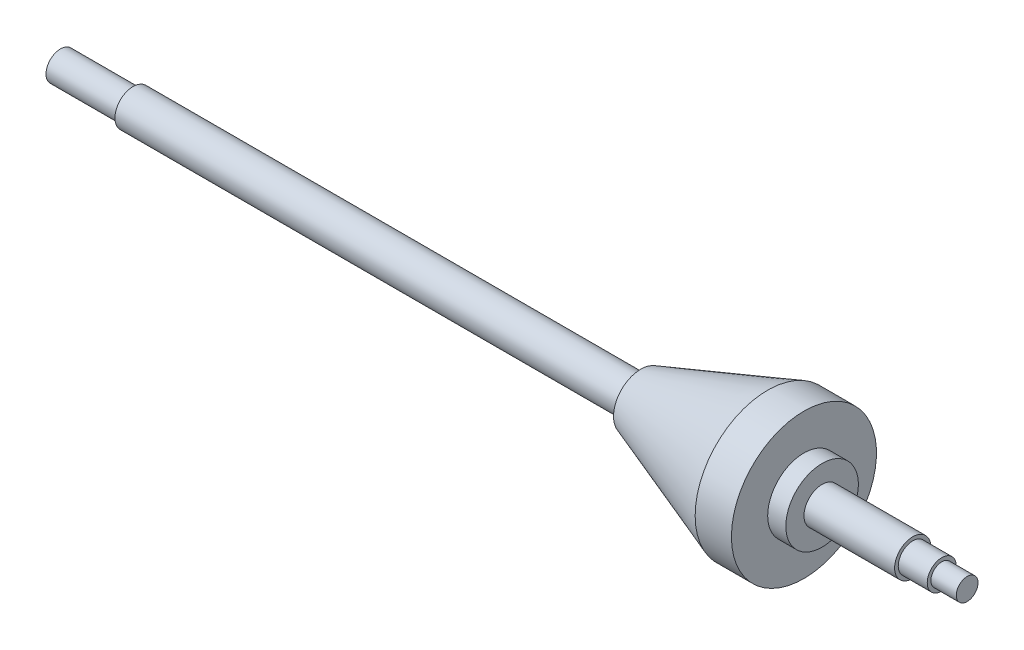
ISO-10303-21;
HEADER;
FILE_DESCRIPTION(('STEP AP214'),'2;1');
FILE_NAME('part.step','',(''),(''),'','','');
FILE_SCHEMA(('AUTOMOTIVE_DESIGN { 1 0 10303 214 1 1 1 1 }'));
ENDSEC;
DATA;
#1=APPLICATION_CONTEXT('core data for automotive mechanical design processes');
#2=APPLICATION_PROTOCOL_DEFINITION('international standard','automotive_design',2000,#1);
#3=PRODUCT_CONTEXT('',#1,'mechanical');
#4=PRODUCT('Part','Part','',(#3));
#5=PRODUCT_RELATED_PRODUCT_CATEGORY('part','',(#4));
#6=PRODUCT_DEFINITION_FORMATION('','',#4);
#7=PRODUCT_DEFINITION_CONTEXT('part definition',#1,'design');
#8=PRODUCT_DEFINITION('design','',#6,#7);
#9=PRODUCT_DEFINITION_SHAPE('','',#8);
#10=(LENGTH_UNIT() NAMED_UNIT(*) SI_UNIT(.MILLI.,.METRE.));
#11=(NAMED_UNIT(*) PLANE_ANGLE_UNIT() SI_UNIT($,.RADIAN.));
#12=(NAMED_UNIT(*) SI_UNIT($,.STERADIAN.) SOLID_ANGLE_UNIT());
#13=UNCERTAINTY_MEASURE_WITH_UNIT(LENGTH_MEASURE(1.E-05),#10,'distance_accuracy_value','');
#14=(GEOMETRIC_REPRESENTATION_CONTEXT(3) GLOBAL_UNCERTAINTY_ASSIGNED_CONTEXT((#13)) GLOBAL_UNIT_ASSIGNED_CONTEXT((#10,
#11,#12)) REPRESENTATION_CONTEXT('',''));
#15=CARTESIAN_POINT('',(0.,0.,0.));
#16=DIRECTION('',(0.,0.,1.));
#17=DIRECTION('',(1.,0.,0.));
#18=AXIS2_PLACEMENT_3D('',#15,#16,#17);
#19=CARTESIAN_POINT('',(0.,0.,0.));
#20=DIRECTION('',(1.,0.,0.));
#21=DIRECTION('',(0.,0.,-1.));
#22=AXIS2_PLACEMENT_3D('',#19,#20,#21);
#23=PLANE('',#22);
#24=CARTESIAN_POINT('',(0.,0.,0.));
#25=DIRECTION('',(-1.,0.,0.));
#26=DIRECTION('',(0.,0.,1.));
#27=AXIS2_PLACEMENT_3D('',#24,#25,#26);
#28=CIRCLE('',#27,4.);
#29=CARTESIAN_POINT('',(0.,0.,4.));
#30=VERTEX_POINT('',#29);
#31=EDGE_CURVE('E10',#30,#30,#28,.T.);
#32=ORIENTED_EDGE('',*,*,#31,.T.);
#33=EDGE_LOOP('',(#32));
#34=FACE_BOUND('',#33,.T.);
#35=ADVANCED_FACE('F31',(#34),#23,.F.);
#36=CARTESIAN_POINT('',(0.,0.,0.));
#37=DIRECTION('',(-1.,0.,0.));
#38=DIRECTION('',(0.,0.,1.));
#39=AXIS2_PLACEMENT_3D('',#36,#37,#38);
#40=CYLINDRICAL_SURFACE('',#39,4.);
#41=ORIENTED_EDGE('',*,*,#31,.F.);
#42=EDGE_LOOP('',(#41));
#43=FACE_BOUND('',#42,.T.);
#44=CARTESIAN_POINT('',(20.,0.,0.));
#45=DIRECTION('',(-1.,0.,0.));
#46=DIRECTION('',(0.,0.,1.));
#47=AXIS2_PLACEMENT_3D('',#44,#45,#46);
#48=CIRCLE('',#47,4.);
#49=CARTESIAN_POINT('',(20.,0.,4.));
#50=VERTEX_POINT('',#49);
#51=EDGE_CURVE('E37',#50,#50,#48,.T.);
#52=ORIENTED_EDGE('',*,*,#51,.T.);
#53=EDGE_LOOP('',(#52));
#54=FACE_BOUND('',#53,.T.);
#55=ADVANCED_FACE('F96',(#43,#54),#40,.T.);
#56=CARTESIAN_POINT('',(20.,4.,0.));
#57=DIRECTION('',(1.,0.,0.));
#58=DIRECTION('',(0.,0.,-1.));
#59=AXIS2_PLACEMENT_3D('',#56,#57,#58);
#60=PLANE('',#59);
#61=ORIENTED_EDGE('',*,*,#51,.F.);
#62=EDGE_LOOP('',(#61));
#63=FACE_BOUND('',#62,.T.);
#64=CARTESIAN_POINT('',(20.,0.,0.));
#65=DIRECTION('',(-1.,0.,0.));
#66=DIRECTION('',(0.,0.,1.));
#67=AXIS2_PLACEMENT_3D('',#64,#65,#66);
#68=CIRCLE('',#67,5.);
#69=CARTESIAN_POINT('',(20.,0.,5.));
#70=VERTEX_POINT('',#69);
#71=EDGE_CURVE('E41',#70,#70,#68,.T.);
#72=ORIENTED_EDGE('',*,*,#71,.T.);
#73=EDGE_LOOP('',(#72));
#74=FACE_BOUND('',#73,.T.);
#75=ADVANCED_FACE('F100',(#63,#74),#60,.F.);
#76=CARTESIAN_POINT('',(0.,0.,0.));
#77=DIRECTION('',(-1.,0.,0.));
#78=DIRECTION('',(0.,0.,1.));
#79=AXIS2_PLACEMENT_3D('',#76,#77,#78);
#80=CYLINDRICAL_SURFACE('',#79,5.);
#81=ORIENTED_EDGE('',*,*,#71,.F.);
#82=EDGE_LOOP('',(#81));
#83=FACE_BOUND('',#82,.T.);
#84=CARTESIAN_POINT('',(160.,0.,0.));
#85=DIRECTION('',(-1.,0.,0.));
#86=DIRECTION('',(0.,0.,1.));
#87=AXIS2_PLACEMENT_3D('',#84,#85,#86);
#88=CIRCLE('',#87,5.);
#89=CARTESIAN_POINT('',(160.,0.,5.));
#90=VERTEX_POINT('',#89);
#91=EDGE_CURVE('E45',#90,#90,#88,.T.);
#92=ORIENTED_EDGE('',*,*,#91,.T.);
#93=EDGE_LOOP('',(#92));
#94=FACE_BOUND('',#93,.T.);
#95=ADVANCED_FACE('F105',(#83,#94),#80,.T.);
#96=CARTESIAN_POINT('',(160.,5.,0.));
#97=DIRECTION('',(1.,0.,0.));
#98=DIRECTION('',(0.,0.,-1.));
#99=AXIS2_PLACEMENT_3D('',#96,#97,#98);
#100=PLANE('',#99);
#101=ORIENTED_EDGE('',*,*,#91,.F.);
#102=EDGE_LOOP('',(#101));
#103=FACE_BOUND('',#102,.T.);
#104=CARTESIAN_POINT('',(160.,0.,0.));
#105=DIRECTION('',(-1.,0.,0.));
#106=DIRECTION('',(0.,0.,1.));
#107=AXIS2_PLACEMENT_3D('',#104,#105,#106);
#108=CIRCLE('',#107,7.5);
#109=CARTESIAN_POINT('',(160.,0.,7.5));
#110=VERTEX_POINT('',#109);
#111=EDGE_CURVE('E50',#110,#110,#108,.T.);
#112=ORIENTED_EDGE('',*,*,#111,.T.);
#113=EDGE_LOOP('',(#112));
#114=FACE_BOUND('',#113,.T.);
#115=ADVANCED_FACE('F111',(#103,#114),#100,.F.);
#116=CARTESIAN_POINT('',(195.,0.,0.));
#117=DIRECTION('',(1.,0.,0.));
#118=DIRECTION('',(0.,0.,-1.));
#119=AXIS2_PLACEMENT_3D('',#116,#117,#118);
#120=CONICAL_SURFACE('',#119,20.,0.343023940420704);
#121=ORIENTED_EDGE('',*,*,#111,.F.);
#122=EDGE_LOOP('',(#121));
#123=FACE_BOUND('',#122,.T.);
#124=CARTESIAN_POINT('',(195.,0.,0.));
#125=DIRECTION('',(-1.,0.,0.));
#126=DIRECTION('',(0.,0.,1.));
#127=AXIS2_PLACEMENT_3D('',#124,#125,#126);
#128=CIRCLE('',#127,20.);
#129=CARTESIAN_POINT('',(195.,0.,20.));
#130=VERTEX_POINT('',#129);
#131=EDGE_CURVE('E53',#130,#130,#128,.T.);
#132=ORIENTED_EDGE('',*,*,#131,.T.);
#133=EDGE_LOOP('',(#132));
#134=FACE_BOUND('',#133,.T.);
#135=ADVANCED_FACE('F115',(#123,#134),#120,.T.);
#136=CARTESIAN_POINT('',(0.,0.,0.));
#137=DIRECTION('',(-1.,0.,0.));
#138=DIRECTION('',(0.,0.,1.));
#139=AXIS2_PLACEMENT_3D('',#136,#137,#138);
#140=CYLINDRICAL_SURFACE('',#139,20.);
#141=ORIENTED_EDGE('',*,*,#131,.F.);
#142=EDGE_LOOP('',(#141));
#143=FACE_BOUND('',#142,.T.);
#144=CARTESIAN_POINT('',(205.,0.,0.));
#145=DIRECTION('',(-1.,0.,0.));
#146=DIRECTION('',(0.,0.,1.));
#147=AXIS2_PLACEMENT_3D('',#144,#145,#146);
#148=CIRCLE('',#147,20.);
#149=CARTESIAN_POINT('',(205.,0.,20.));
#150=VERTEX_POINT('',#149);
#151=EDGE_CURVE('E56',#150,#150,#148,.T.);
#152=ORIENTED_EDGE('',*,*,#151,.T.);
#153=EDGE_LOOP('',(#152));
#154=FACE_BOUND('',#153,.T.);
#155=ADVANCED_FACE('F119',(#143,#154),#140,.T.);
#156=CARTESIAN_POINT('',(205.,20.,0.));
#157=DIRECTION('',(-1.,0.,0.));
#158=DIRECTION('',(0.,0.,1.));
#159=AXIS2_PLACEMENT_3D('',#156,#157,#158);
#160=PLANE('',#159);
#161=ORIENTED_EDGE('',*,*,#151,.F.);
#162=EDGE_LOOP('',(#161));
#163=FACE_BOUND('',#162,.T.);
#164=CARTESIAN_POINT('',(205.,0.,0.));
#165=DIRECTION('',(-1.,0.,0.));
#166=DIRECTION('',(0.,0.,1.));
#167=AXIS2_PLACEMENT_3D('',#164,#165,#166);
#168=CIRCLE('',#167,10.);
#169=CARTESIAN_POINT('',(205.,0.,10.));
#170=VERTEX_POINT('',#169);
#171=EDGE_CURVE('E59',#170,#170,#168,.T.);
#172=ORIENTED_EDGE('',*,*,#171,.T.);
#173=EDGE_LOOP('',(#172));
#174=FACE_BOUND('',#173,.T.);
#175=ADVANCED_FACE('F123',(#163,#174),#160,.F.);
#176=CARTESIAN_POINT('',(0.,0.,0.));
#177=DIRECTION('',(-1.,0.,0.));
#178=DIRECTION('',(0.,0.,1.));
#179=AXIS2_PLACEMENT_3D('',#176,#177,#178);
#180=CYLINDRICAL_SURFACE('',#179,10.);
#181=ORIENTED_EDGE('',*,*,#171,.F.);
#182=EDGE_LOOP('',(#181));
#183=FACE_BOUND('',#182,.T.);
#184=CARTESIAN_POINT('',(210.,0.,0.));
#185=DIRECTION('',(-1.,0.,0.));
#186=DIRECTION('',(0.,0.,1.));
#187=AXIS2_PLACEMENT_3D('',#184,#185,#186);
#188=CIRCLE('',#187,10.);
#189=CARTESIAN_POINT('',(210.,0.,10.));
#190=VERTEX_POINT('',#189);
#191=EDGE_CURVE('E62',#190,#190,#188,.T.);
#192=ORIENTED_EDGE('',*,*,#191,.T.);
#193=EDGE_LOOP('',(#192));
#194=FACE_BOUND('',#193,.T.);
#195=ADVANCED_FACE('F127',(#183,#194),#180,.T.);
#196=CARTESIAN_POINT('',(210.,10.,0.));
#197=DIRECTION('',(-1.,0.,0.));
#198=DIRECTION('',(0.,0.,1.));
#199=AXIS2_PLACEMENT_3D('',#196,#197,#198);
#200=PLANE('',#199);
#201=ORIENTED_EDGE('',*,*,#191,.F.);
#202=EDGE_LOOP('',(#201));
#203=FACE_BOUND('',#202,.T.);
#204=CARTESIAN_POINT('',(210.,0.,0.));
#205=DIRECTION('',(-1.,0.,0.));
#206=DIRECTION('',(0.,0.,1.));
#207=AXIS2_PLACEMENT_3D('',#204,#205,#206);
#208=CIRCLE('',#207,5.);
#209=CARTESIAN_POINT('',(210.,0.,5.));
#210=VERTEX_POINT('',#209);
#211=EDGE_CURVE('E65',#210,#210,#208,.T.);
#212=ORIENTED_EDGE('',*,*,#211,.T.);
#213=EDGE_LOOP('',(#212));
#214=FACE_BOUND('',#213,.T.);
#215=ADVANCED_FACE('F131',(#203,#214),#200,.F.);
#216=CARTESIAN_POINT('',(0.,0.,0.));
#217=DIRECTION('',(-1.,0.,0.));
#218=DIRECTION('',(0.,0.,1.));
#219=AXIS2_PLACEMENT_3D('',#216,#217,#218);
#220=CYLINDRICAL_SURFACE('',#219,5.);
#221=ORIENTED_EDGE('',*,*,#211,.F.);
#222=EDGE_LOOP('',(#221));
#223=FACE_BOUND('',#222,.T.);
#224=CARTESIAN_POINT('',(235.,0.,0.));
#225=DIRECTION('',(-1.,0.,0.));
#226=DIRECTION('',(0.,0.,1.));
#227=AXIS2_PLACEMENT_3D('',#224,#225,#226);
#228=CIRCLE('',#227,5.);
#229=CARTESIAN_POINT('',(235.,0.,5.));
#230=VERTEX_POINT('',#229);
#231=EDGE_CURVE('E68',#230,#230,#228,.T.);
#232=ORIENTED_EDGE('',*,*,#231,.T.);
#233=EDGE_LOOP('',(#232));
#234=FACE_BOUND('',#233,.T.);
#235=ADVANCED_FACE('F135',(#223,#234),#220,.T.);
#236=CARTESIAN_POINT('',(235.,5.,0.));
#237=DIRECTION('',(-1.,0.,0.));
#238=DIRECTION('',(0.,0.,1.));
#239=AXIS2_PLACEMENT_3D('',#236,#237,#238);
#240=PLANE('',#239);
#241=ORIENTED_EDGE('',*,*,#231,.F.);
#242=EDGE_LOOP('',(#241));
#243=FACE_BOUND('',#242,.T.);
#244=CARTESIAN_POINT('',(235.,0.,0.));
#245=DIRECTION('',(-1.,0.,0.));
#246=DIRECTION('',(0.,0.,1.));
#247=AXIS2_PLACEMENT_3D('',#244,#245,#246);
#248=CIRCLE('',#247,4.);
#249=CARTESIAN_POINT('',(235.,0.,4.));
#250=VERTEX_POINT('',#249);
#251=EDGE_CURVE('E71',#250,#250,#248,.T.);
#252=ORIENTED_EDGE('',*,*,#251,.T.);
#253=EDGE_LOOP('',(#252));
#254=FACE_BOUND('',#253,.T.);
#255=ADVANCED_FACE('F139',(#243,#254),#240,.F.);
#256=CARTESIAN_POINT('',(0.,0.,0.));
#257=DIRECTION('',(-1.,0.,0.));
#258=DIRECTION('',(0.,0.,1.));
#259=AXIS2_PLACEMENT_3D('',#256,#257,#258);
#260=CYLINDRICAL_SURFACE('',#259,4.);
#261=ORIENTED_EDGE('',*,*,#251,.F.);
#262=EDGE_LOOP('',(#261));
#263=FACE_BOUND('',#262,.T.);
#264=CARTESIAN_POINT('',(243.,0.,0.));
#265=DIRECTION('',(-1.,0.,0.));
#266=DIRECTION('',(0.,0.,1.));
#267=AXIS2_PLACEMENT_3D('',#264,#265,#266);
#268=CIRCLE('',#267,4.);
#269=CARTESIAN_POINT('',(243.,0.,4.));
#270=VERTEX_POINT('',#269);
#271=EDGE_CURVE('E74',#270,#270,#268,.T.);
#272=ORIENTED_EDGE('',*,*,#271,.T.);
#273=EDGE_LOOP('',(#272));
#274=FACE_BOUND('',#273,.T.);
#275=ADVANCED_FACE('F143',(#263,#274),#260,.T.);
#276=CARTESIAN_POINT('',(243.,4.,0.));
#277=DIRECTION('',(-1.,0.,0.));
#278=DIRECTION('',(0.,0.,1.));
#279=AXIS2_PLACEMENT_3D('',#276,#277,#278);
#280=PLANE('',#279);
#281=ORIENTED_EDGE('',*,*,#271,.F.);
#282=EDGE_LOOP('',(#281));
#283=FACE_BOUND('',#282,.T.);
#284=CARTESIAN_POINT('',(243.,0.,0.));
#285=DIRECTION('',(-1.,0.,0.));
#286=DIRECTION('',(0.,0.,1.));
#287=AXIS2_PLACEMENT_3D('',#284,#285,#286);
#288=CIRCLE('',#287,3.);
#289=CARTESIAN_POINT('',(243.,0.,3.));
#290=VERTEX_POINT('',#289);
#291=EDGE_CURVE('E77',#290,#290,#288,.T.);
#292=ORIENTED_EDGE('',*,*,#291,.T.);
#293=EDGE_LOOP('',(#292));
#294=FACE_BOUND('',#293,.T.);
#295=ADVANCED_FACE('F92',(#283,#294),#280,.F.);
#296=CARTESIAN_POINT('',(0.,0.,0.));
#297=DIRECTION('',(-1.,0.,0.));
#298=DIRECTION('',(0.,0.,1.));
#299=AXIS2_PLACEMENT_3D('',#296,#297,#298);
#300=CYLINDRICAL_SURFACE('',#299,3.);
#301=ORIENTED_EDGE('',*,*,#291,.F.);
#302=EDGE_LOOP('',(#301));
#303=FACE_BOUND('',#302,.T.);
#304=CARTESIAN_POINT('',(250.,0.,0.));
#305=DIRECTION('',(-1.,0.,0.));
#306=DIRECTION('',(0.,0.,1.));
#307=AXIS2_PLACEMENT_3D('',#304,#305,#306);
#308=CIRCLE('',#307,3.);
#309=CARTESIAN_POINT('',(250.,0.,3.));
#310=VERTEX_POINT('',#309);
#311=EDGE_CURVE('E80',#310,#310,#308,.T.);
#312=ORIENTED_EDGE('',*,*,#311,.T.);
#313=EDGE_LOOP('',(#312));
#314=FACE_BOUND('',#313,.T.);
#315=ADVANCED_FACE('F84',(#303,#314),#300,.T.);
#316=CARTESIAN_POINT('',(250.,3.,0.));
#317=DIRECTION('',(-1.,0.,0.));
#318=DIRECTION('',(0.,0.,1.));
#319=AXIS2_PLACEMENT_3D('',#316,#317,#318);
#320=PLANE('',#319);
#321=ORIENTED_EDGE('',*,*,#311,.F.);
#322=EDGE_LOOP('',(#321));
#323=FACE_BOUND('',#322,.T.);
#324=ADVANCED_FACE('F86',(#323),#320,.F.);
#325=CLOSED_SHELL('',(#35,#55,#75,#95,#115,#135,#155,#175,#195,#215,#235,#255,#275,#295,#315,#324));
#326=MANIFOLD_SOLID_BREP('B2',#325);
#327=ADVANCED_BREP_SHAPE_REPRESENTATION('',(#18,#326),#14);
#328=SHAPE_DEFINITION_REPRESENTATION(#9,#327);
ENDSEC;
END-ISO-10303-21;
